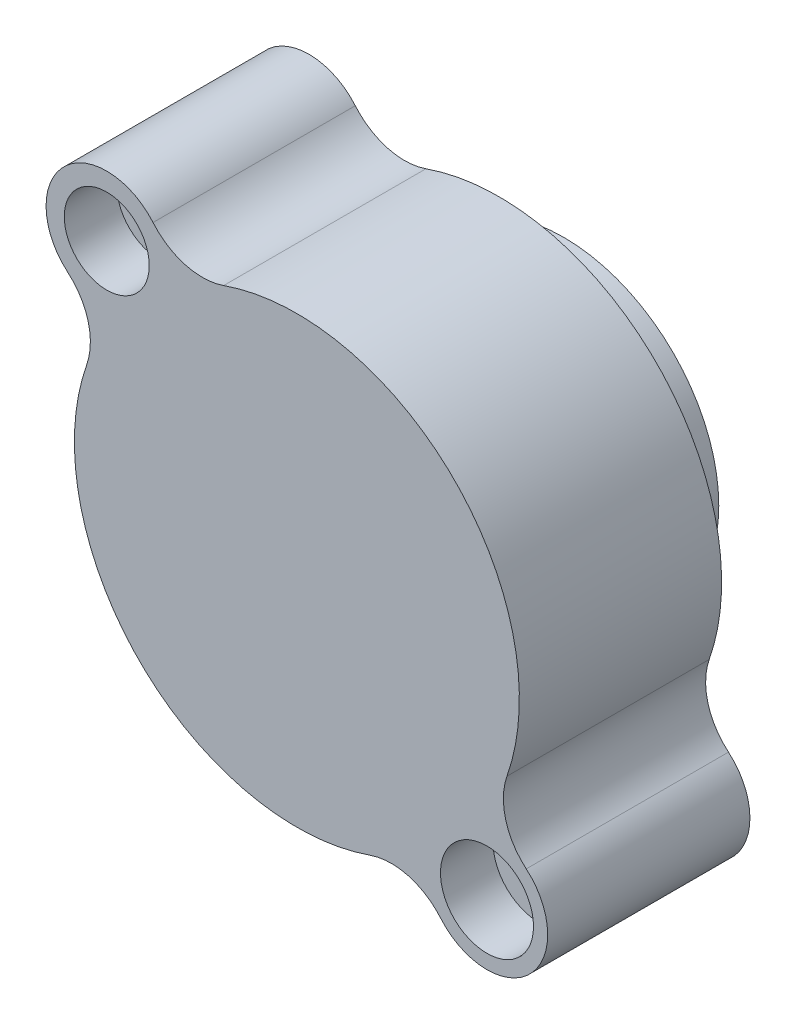
ISO-10303-21;
HEADER;
FILE_DESCRIPTION(('STEP AP214'),'2;1');
FILE_NAME('part.step','',(''),(''),'','','');
FILE_SCHEMA(('AUTOMOTIVE_DESIGN { 1 0 10303 214 1 1 1 1 }'));
ENDSEC;
DATA;
#1=APPLICATION_CONTEXT('core data for automotive mechanical design processes');
#2=APPLICATION_PROTOCOL_DEFINITION('international standard','automotive_design',2000,#1);
#3=PRODUCT_CONTEXT('',#1,'mechanical');
#4=PRODUCT('Part','Part','',(#3));
#5=PRODUCT_RELATED_PRODUCT_CATEGORY('part','',(#4));
#6=PRODUCT_DEFINITION_FORMATION('','',#4);
#7=PRODUCT_DEFINITION_CONTEXT('part definition',#1,'design');
#8=PRODUCT_DEFINITION('design','',#6,#7);
#9=PRODUCT_DEFINITION_SHAPE('','',#8);
#10=(LENGTH_UNIT() NAMED_UNIT(*) SI_UNIT(.MILLI.,.METRE.));
#11=(NAMED_UNIT(*) PLANE_ANGLE_UNIT() SI_UNIT($,.RADIAN.));
#12=(NAMED_UNIT(*) SI_UNIT($,.STERADIAN.) SOLID_ANGLE_UNIT());
#13=UNCERTAINTY_MEASURE_WITH_UNIT(LENGTH_MEASURE(1.E-05),#10,'distance_accuracy_value','');
#14=(GEOMETRIC_REPRESENTATION_CONTEXT(3) GLOBAL_UNCERTAINTY_ASSIGNED_CONTEXT((#13)) GLOBAL_UNIT_ASSIGNED_CONTEXT((#10,
#11,#12)) REPRESENTATION_CONTEXT('',''));
#15=CARTESIAN_POINT('',(0.,0.,0.));
#16=DIRECTION('',(0.,0.,1.));
#17=DIRECTION('',(1.,0.,0.));
#18=AXIS2_PLACEMENT_3D('',#15,#16,#17);
#19=CARTESIAN_POINT('',(-724.208508460082,446.758512816513,203.2));
#20=DIRECTION('',(0.,0.,1.));
#21=DIRECTION('',(1.,0.,0.));
#22=AXIS2_PLACEMENT_3D('',#19,#20,#21);
#23=PLANE('',#22);
#24=CARTESIAN_POINT('',(596.9,-596.9,203.2));
#25=DIRECTION('',(0.,0.,1.));
#26=DIRECTION('',(1.,0.,0.));
#27=AXIS2_PLACEMENT_3D('',#24,#25,#26);
#28=CIRCLE('',#27,69.85);
#29=CARTESIAN_POINT('',(666.75,-596.9,203.2));
#30=VERTEX_POINT('',#29);
#31=EDGE_CURVE('E39',#30,#30,#28,.T.);
#32=ORIENTED_EDGE('',*,*,#31,.T.);
#33=EDGE_LOOP('',(#32));
#34=FACE_BOUND('',#33,.T.);
#35=CARTESIAN_POINT('',(-596.9,596.9,203.2));
#36=DIRECTION('',(0.,0.,1.));
#37=DIRECTION('',(1.,0.,0.));
#38=AXIS2_PLACEMENT_3D('',#35,#36,#37);
#39=CIRCLE('',#38,69.85);
#40=CARTESIAN_POINT('',(-527.05,596.9,203.2));
#41=VERTEX_POINT('',#40);
#42=EDGE_CURVE('E168',#41,#41,#39,.T.);
#43=ORIENTED_EDGE('',*,*,#42,.T.);
#44=EDGE_LOOP('',(#43));
#45=FACE_BOUND('',#44,.T.);
#46=CARTESIAN_POINT('',(-596.9,596.9,203.2));
#47=DIRECTION('',(0.,0.,1.));
#48=DIRECTION('',(1.,0.,0.));
#49=AXIS2_PLACEMENT_3D('',#46,#47,#48);
#50=CIRCLE('',#49,190.5);
#51=CARTESIAN_POINT('',(-451.601786596628,720.101782380728,203.2));
#52=VERTEX_POINT('',#51);
#53=CARTESIAN_POINT('',(-720.101782380725,451.601786596626,203.2));
#54=VERTEX_POINT('',#53);
#55=EDGE_CURVE('E158',#52,#54,#50,.T.);
#56=ORIENTED_EDGE('',*,*,#55,.F.);
#57=CARTESIAN_POINT('',(-296.617025633027,851.517016920165,203.2));
#58=DIRECTION('',(0.,0.,-1.));
#59=DIRECTION('',(-1.,0.,0.));
#60=AXIS2_PLACEMENT_3D('',#57,#58,#59);
#61=CIRCLE('',#60,203.2);
#62=CARTESIAN_POINT('',(-229.773752250937,659.625858177592,203.2));
#63=VERTEX_POINT('',#62);
#64=EDGE_CURVE('E126',#63,#52,#61,.T.);
#65=ORIENTED_EDGE('',*,*,#64,.F.);
#66=CARTESIAN_POINT('',(0.,0.,203.2));
#67=DIRECTION('',(0.,0.,1.));
#68=DIRECTION('',(1.,0.,0.));
#69=AXIS2_PLACEMENT_3D('',#66,#67,#68);
#70=CIRCLE('',#69,698.5);
#71=CARTESIAN_POINT('',(659.625858177592,-229.773752250936,203.2));
#72=VERTEX_POINT('',#71);
#73=EDGE_CURVE('E111',#72,#63,#70,.T.);
#74=ORIENTED_EDGE('',*,*,#73,.F.);
#75=CARTESIAN_POINT('',(851.517016920165,-296.617025633027,203.2));
#76=DIRECTION('',(0.,0.,-1.));
#77=DIRECTION('',(-1.,0.,0.));
#78=AXIS2_PLACEMENT_3D('',#75,#76,#77);
#79=CIRCLE('',#78,203.2);
#80=CARTESIAN_POINT('',(720.101782380725,-451.601786596626,203.2));
#81=VERTEX_POINT('',#80);
#82=EDGE_CURVE('E124',#81,#72,#79,.T.);
#83=ORIENTED_EDGE('',*,*,#82,.F.);
#84=CARTESIAN_POINT('',(596.9,-596.9,203.2));
#85=DIRECTION('',(0.,0.,1.));
#86=DIRECTION('',(1.,0.,0.));
#87=AXIS2_PLACEMENT_3D('',#84,#85,#86);
#88=CIRCLE('',#87,190.5);
#89=CARTESIAN_POINT('',(451.601786596626,-720.101782380725,203.2));
#90=VERTEX_POINT('',#89);
#91=EDGE_CURVE('E129',#90,#81,#88,.T.);
#92=ORIENTED_EDGE('',*,*,#91,.F.);
#93=CARTESIAN_POINT('',(296.617025633027,-851.517016920165,203.2));
#94=DIRECTION('',(0.,0.,-1.));
#95=DIRECTION('',(-1.,0.,0.));
#96=AXIS2_PLACEMENT_3D('',#93,#94,#95);
#97=CIRCLE('',#96,203.2);
#98=CARTESIAN_POINT('',(229.773752250936,-659.625858177593,203.2));
#99=VERTEX_POINT('',#98);
#100=EDGE_CURVE('E131',#99,#90,#97,.T.);
#101=ORIENTED_EDGE('',*,*,#100,.F.);
#102=CARTESIAN_POINT('',(0.,0.,203.2));
#103=DIRECTION('',(0.,0.,1.));
#104=DIRECTION('',(1.,0.,0.));
#105=AXIS2_PLACEMENT_3D('',#102,#103,#104);
#106=CIRCLE('',#105,698.5);
#107=CARTESIAN_POINT('',(-659.625858177592,229.773752250936,203.2));
#108=VERTEX_POINT('',#107);
#109=EDGE_CURVE('E188',#108,#99,#106,.T.);
#110=ORIENTED_EDGE('',*,*,#109,.F.);
#111=CARTESIAN_POINT('',(-851.517016920165,296.617025633026,203.2));
#112=DIRECTION('',(0.,0.,-1.));
#113=DIRECTION('',(-1.,0.,0.));
#114=AXIS2_PLACEMENT_3D('',#111,#112,#113);
#115=CIRCLE('',#114,203.2);
#116=EDGE_CURVE('E186',#54,#108,#115,.T.);
#117=ORIENTED_EDGE('',*,*,#116,.F.);
#118=EDGE_LOOP('',(#56,#65,#74,#83,#92,#101,#110,#117));
#119=FACE_BOUND('',#118,.T.);
#120=CARTESIAN_POINT('',(0.,0.,203.2));
#121=DIRECTION('',(0.,0.,1.));
#122=DIRECTION('',(1.,0.,0.));
#123=AXIS2_PLACEMENT_3D('',#120,#121,#122);
#124=CIRCLE('',#123,486.41);
#125=CARTESIAN_POINT('',(486.41,0.,203.2));
#126=VERTEX_POINT('',#125);
#127=EDGE_CURVE('E11',#126,#126,#124,.F.);
#128=ORIENTED_EDGE('',*,*,#127,.F.);
#129=EDGE_LOOP('',(#128));
#130=FACE_BOUND('',#129,.T.);
#131=ADVANCED_FACE('F35',(#34,#45,#119,#130),#23,.F.);
#132=CARTESIAN_POINT('',(-596.9,596.9,203.2));
#133=DIRECTION('',(0.,0.,1.));
#134=DIRECTION('',(1.,0.,0.));
#135=AXIS2_PLACEMENT_3D('',#132,#133,#134);
#136=CYLINDRICAL_SURFACE('',#135,190.5);
#137=CARTESIAN_POINT('',(-596.9,596.9,838.2));
#138=DIRECTION('',(0.,0.,1.));
#139=DIRECTION('',(1.,0.,0.));
#140=AXIS2_PLACEMENT_3D('',#137,#138,#139);
#141=CIRCLE('',#140,190.5);
#142=CARTESIAN_POINT('',(-451.601786596628,720.101782380728,838.2));
#143=VERTEX_POINT('',#142);
#144=CARTESIAN_POINT('',(-720.101782380725,451.601786596626,838.2));
#145=VERTEX_POINT('',#144);
#146=EDGE_CURVE('E136',#143,#145,#141,.T.);
#147=ORIENTED_EDGE('',*,*,#146,.F.);
#148=DIRECTION('',(0.,0.,1.));
#149=VECTOR('',#148,1.);
#150=CARTESIAN_POINT('',(-451.601786596628,720.101782380728,203.2));
#151=LINE('',#150,#149);
#152=EDGE_CURVE('E45',#52,#143,#151,.T.);
#153=ORIENTED_EDGE('',*,*,#152,.F.);
#154=ORIENTED_EDGE('',*,*,#55,.T.);
#155=DIRECTION('',(0.,0.,1.));
#156=VECTOR('',#155,1.);
#157=CARTESIAN_POINT('',(-720.101782380725,451.601786596626,203.2));
#158=LINE('',#157,#156);
#159=EDGE_CURVE('E94',#54,#145,#158,.T.);
#160=ORIENTED_EDGE('',*,*,#159,.T.);
#161=EDGE_LOOP('',(#147,#153,#154,#160));
#162=FACE_BOUND('',#161,.T.);
#163=ADVANCED_FACE('F37',(#162),#136,.T.);
#164=CARTESIAN_POINT('',(-296.617025633027,851.517016920165,203.2));
#165=DIRECTION('',(0.,0.,1.));
#166=DIRECTION('',(1.,0.,0.));
#167=AXIS2_PLACEMENT_3D('',#164,#165,#166);
#168=CYLINDRICAL_SURFACE('',#167,203.2);
#169=CARTESIAN_POINT('',(-296.617025633027,851.517016920165,838.2));
#170=DIRECTION('',(0.,0.,-1.));
#171=DIRECTION('',(-1.,0.,0.));
#172=AXIS2_PLACEMENT_3D('',#169,#170,#171);
#173=CIRCLE('',#172,203.2);
#174=CARTESIAN_POINT('',(-229.773752250937,659.625858177592,838.2));
#175=VERTEX_POINT('',#174);
#176=EDGE_CURVE('E155',#175,#143,#173,.T.);
#177=ORIENTED_EDGE('',*,*,#176,.F.);
#178=DIRECTION('',(0.,0.,1.));
#179=VECTOR('',#178,1.);
#180=CARTESIAN_POINT('',(-229.773752250937,659.625858177592,203.2));
#181=LINE('',#180,#179);
#182=EDGE_CURVE('E82',#63,#175,#181,.T.);
#183=ORIENTED_EDGE('',*,*,#182,.F.);
#184=ORIENTED_EDGE('',*,*,#64,.T.);
#185=ORIENTED_EDGE('',*,*,#152,.T.);
#186=EDGE_LOOP('',(#177,#183,#184,#185));
#187=FACE_BOUND('',#186,.T.);
#188=ADVANCED_FACE('F203',(#187),#168,.F.);
#189=CARTESIAN_POINT('',(0.,0.,203.2));
#190=DIRECTION('',(0.,0.,1.));
#191=DIRECTION('',(1.,0.,0.));
#192=AXIS2_PLACEMENT_3D('',#189,#190,#191);
#193=CYLINDRICAL_SURFACE('',#192,698.5);
#194=CARTESIAN_POINT('',(0.,0.,838.2));
#195=DIRECTION('',(0.,0.,1.));
#196=DIRECTION('',(1.,0.,0.));
#197=AXIS2_PLACEMENT_3D('',#194,#195,#196);
#198=CIRCLE('',#197,698.5);
#199=CARTESIAN_POINT('',(659.625858177592,-229.773752250936,838.2));
#200=VERTEX_POINT('',#199);
#201=EDGE_CURVE('E113',#200,#175,#198,.T.);
#202=ORIENTED_EDGE('',*,*,#201,.F.);
#203=DIRECTION('',(0.,0.,1.));
#204=VECTOR('',#203,1.);
#205=CARTESIAN_POINT('',(659.625858177592,-229.773752250936,203.2));
#206=LINE('',#205,#204);
#207=EDGE_CURVE('E108',#72,#200,#206,.T.);
#208=ORIENTED_EDGE('',*,*,#207,.F.);
#209=ORIENTED_EDGE('',*,*,#73,.T.);
#210=ORIENTED_EDGE('',*,*,#182,.T.);
#211=EDGE_LOOP('',(#202,#208,#209,#210));
#212=FACE_BOUND('',#211,.T.);
#213=ADVANCED_FACE('F110',(#212),#193,.T.);
#214=CARTESIAN_POINT('',(851.517016920165,-296.617025633027,203.2));
#215=DIRECTION('',(0.,0.,1.));
#216=DIRECTION('',(1.,0.,0.));
#217=AXIS2_PLACEMENT_3D('',#214,#215,#216);
#218=CYLINDRICAL_SURFACE('',#217,203.2);
#219=CARTESIAN_POINT('',(851.517016920165,-296.617025633027,838.2));
#220=DIRECTION('',(0.,0.,-1.));
#221=DIRECTION('',(-1.,0.,0.));
#222=AXIS2_PLACEMENT_3D('',#219,#220,#221);
#223=CIRCLE('',#222,203.2);
#224=CARTESIAN_POINT('',(720.101782380725,-451.601786596626,838.2));
#225=VERTEX_POINT('',#224);
#226=EDGE_CURVE('E152',#225,#200,#223,.T.);
#227=ORIENTED_EDGE('',*,*,#226,.F.);
#228=DIRECTION('',(0.,0.,1.));
#229=VECTOR('',#228,1.);
#230=CARTESIAN_POINT('',(720.101782380725,-451.601786596626,203.2));
#231=LINE('',#230,#229);
#232=EDGE_CURVE('E118',#81,#225,#231,.T.);
#233=ORIENTED_EDGE('',*,*,#232,.F.);
#234=ORIENTED_EDGE('',*,*,#82,.T.);
#235=ORIENTED_EDGE('',*,*,#207,.T.);
#236=EDGE_LOOP('',(#227,#233,#234,#235));
#237=FACE_BOUND('',#236,.T.);
#238=ADVANCED_FACE('F128',(#237),#218,.F.);
#239=CARTESIAN_POINT('',(596.9,-596.9,203.2));
#240=DIRECTION('',(0.,0.,1.));
#241=DIRECTION('',(1.,0.,0.));
#242=AXIS2_PLACEMENT_3D('',#239,#240,#241);
#243=CYLINDRICAL_SURFACE('',#242,190.5);
#244=CARTESIAN_POINT('',(596.9,-596.9,838.2));
#245=DIRECTION('',(0.,0.,1.));
#246=DIRECTION('',(1.,0.,0.));
#247=AXIS2_PLACEMENT_3D('',#244,#245,#246);
#248=CIRCLE('',#247,190.5);
#249=CARTESIAN_POINT('',(451.601786596626,-720.101782380725,838.2));
#250=VERTEX_POINT('',#249);
#251=EDGE_CURVE('E149',#250,#225,#248,.T.);
#252=ORIENTED_EDGE('',*,*,#251,.F.);
#253=DIRECTION('',(0.,0.,1.));
#254=VECTOR('',#253,1.);
#255=CARTESIAN_POINT('',(451.601786596626,-720.101782380725,203.2));
#256=LINE('',#255,#254);
#257=EDGE_CURVE('E162',#90,#250,#256,.T.);
#258=ORIENTED_EDGE('',*,*,#257,.F.);
#259=ORIENTED_EDGE('',*,*,#91,.T.);
#260=ORIENTED_EDGE('',*,*,#232,.T.);
#261=EDGE_LOOP('',(#252,#258,#259,#260));
#262=FACE_BOUND('',#261,.T.);
#263=ADVANCED_FACE('F347',(#262),#243,.T.);
#264=CARTESIAN_POINT('',(296.617025633027,-851.517016920165,203.2));
#265=DIRECTION('',(0.,0.,1.));
#266=DIRECTION('',(1.,0.,0.));
#267=AXIS2_PLACEMENT_3D('',#264,#265,#266);
#268=CYLINDRICAL_SURFACE('',#267,203.2);
#269=CARTESIAN_POINT('',(296.617025633027,-851.517016920165,838.2));
#270=DIRECTION('',(0.,0.,-1.));
#271=DIRECTION('',(-1.,0.,0.));
#272=AXIS2_PLACEMENT_3D('',#269,#270,#271);
#273=CIRCLE('',#272,203.2);
#274=CARTESIAN_POINT('',(229.773752250936,-659.625858177593,838.2));
#275=VERTEX_POINT('',#274);
#276=EDGE_CURVE('E146',#275,#250,#273,.T.);
#277=ORIENTED_EDGE('',*,*,#276,.F.);
#278=DIRECTION('',(0.,0.,1.));
#279=VECTOR('',#278,1.);
#280=CARTESIAN_POINT('',(229.773752250936,-659.625858177593,203.2));
#281=LINE('',#280,#279);
#282=EDGE_CURVE('E164',#99,#275,#281,.T.);
#283=ORIENTED_EDGE('',*,*,#282,.F.);
#284=ORIENTED_EDGE('',*,*,#100,.T.);
#285=ORIENTED_EDGE('',*,*,#257,.T.);
#286=EDGE_LOOP('',(#277,#283,#284,#285));
#287=FACE_BOUND('',#286,.T.);
#288=ADVANCED_FACE('F194',(#287),#268,.F.);
#289=CARTESIAN_POINT('',(0.,0.,203.2));
#290=DIRECTION('',(0.,0.,1.));
#291=DIRECTION('',(1.,0.,0.));
#292=AXIS2_PLACEMENT_3D('',#289,#290,#291);
#293=CYLINDRICAL_SURFACE('',#292,698.5);
#294=CARTESIAN_POINT('',(0.,0.,838.2));
#295=DIRECTION('',(0.,0.,1.));
#296=DIRECTION('',(1.,0.,0.));
#297=AXIS2_PLACEMENT_3D('',#294,#295,#296);
#298=CIRCLE('',#297,698.5);
#299=CARTESIAN_POINT('',(-659.625858177592,229.773752250936,838.2));
#300=VERTEX_POINT('',#299);
#301=EDGE_CURVE('E143',#300,#275,#298,.T.);
#302=ORIENTED_EDGE('',*,*,#301,.F.);
#303=DIRECTION('',(0.,0.,1.));
#304=VECTOR('',#303,1.);
#305=CARTESIAN_POINT('',(-659.625858177592,229.773752250936,203.2));
#306=LINE('',#305,#304);
#307=EDGE_CURVE('E166',#108,#300,#306,.T.);
#308=ORIENTED_EDGE('',*,*,#307,.F.);
#309=ORIENTED_EDGE('',*,*,#109,.T.);
#310=ORIENTED_EDGE('',*,*,#282,.T.);
#311=EDGE_LOOP('',(#302,#308,#309,#310));
#312=FACE_BOUND('',#311,.T.);
#313=ADVANCED_FACE('F199',(#312),#293,.T.);
#314=CARTESIAN_POINT('',(-851.517016920165,296.617025633026,203.2));
#315=DIRECTION('',(0.,0.,1.));
#316=DIRECTION('',(1.,0.,0.));
#317=AXIS2_PLACEMENT_3D('',#314,#315,#316);
#318=CYLINDRICAL_SURFACE('',#317,203.2);
#319=CARTESIAN_POINT('',(-851.517016920165,296.617025633026,838.2));
#320=DIRECTION('',(0.,0.,-1.));
#321=DIRECTION('',(-1.,0.,0.));
#322=AXIS2_PLACEMENT_3D('',#319,#320,#321);
#323=CIRCLE('',#322,203.2);
#324=EDGE_CURVE('E139',#145,#300,#323,.T.);
#325=ORIENTED_EDGE('',*,*,#324,.F.);
#326=ORIENTED_EDGE('',*,*,#159,.F.);
#327=ORIENTED_EDGE('',*,*,#116,.T.);
#328=ORIENTED_EDGE('',*,*,#307,.T.);
#329=EDGE_LOOP('',(#325,#326,#327,#328));
#330=FACE_BOUND('',#329,.T.);
#331=ADVANCED_FACE('F200',(#330),#318,.F.);
#332=CARTESIAN_POINT('',(-724.208508460082,446.758512816513,838.2));
#333=DIRECTION('',(0.,0.,1.));
#334=DIRECTION('',(1.,0.,0.));
#335=AXIS2_PLACEMENT_3D('',#332,#333,#334);
#336=PLANE('',#335);
#337=CARTESIAN_POINT('',(596.9,-596.9,838.2));
#338=DIRECTION('',(0.,0.,1.));
#339=DIRECTION('',(1.,0.,0.));
#340=AXIS2_PLACEMENT_3D('',#337,#338,#339);
#341=CIRCLE('',#340,146.05);
#342=CARTESIAN_POINT('',(742.95,-596.9,838.2));
#343=VERTEX_POINT('',#342);
#344=EDGE_CURVE('E232',#343,#343,#341,.T.);
#345=ORIENTED_EDGE('',*,*,#344,.F.);
#346=EDGE_LOOP('',(#345));
#347=FACE_BOUND('',#346,.T.);
#348=CARTESIAN_POINT('',(-596.9,596.9,838.2));
#349=DIRECTION('',(0.,0.,1.));
#350=DIRECTION('',(1.,0.,0.));
#351=AXIS2_PLACEMENT_3D('',#348,#349,#350);
#352=CIRCLE('',#351,133.35);
#353=CARTESIAN_POINT('',(-463.55,596.9,838.2));
#354=VERTEX_POINT('',#353);
#355=EDGE_CURVE('E181',#354,#354,#352,.T.);
#356=ORIENTED_EDGE('',*,*,#355,.F.);
#357=EDGE_LOOP('',(#356));
#358=FACE_BOUND('',#357,.T.);
#359=ORIENTED_EDGE('',*,*,#146,.T.);
#360=ORIENTED_EDGE('',*,*,#324,.T.);
#361=ORIENTED_EDGE('',*,*,#301,.T.);
#362=ORIENTED_EDGE('',*,*,#276,.T.);
#363=ORIENTED_EDGE('',*,*,#251,.T.);
#364=ORIENTED_EDGE('',*,*,#226,.T.);
#365=ORIENTED_EDGE('',*,*,#201,.T.);
#366=ORIENTED_EDGE('',*,*,#176,.T.);
#367=EDGE_LOOP('',(#359,#360,#361,#362,#363,#364,#365,#366));
#368=FACE_BOUND('',#367,.T.);
#369=ADVANCED_FACE('F202',(#347,#358,#368),#336,.T.);
#370=CARTESIAN_POINT('',(0.,0.,0.));
#371=DIRECTION('',(0.,0.,1.));
#372=DIRECTION('',(1.,0.,0.));
#373=AXIS2_PLACEMENT_3D('',#370,#371,#372);
#374=CYLINDRICAL_SURFACE('',#373,486.41);
#375=CARTESIAN_POINT('',(0.,0.,0.));
#376=DIRECTION('',(0.,0.,-1.));
#377=DIRECTION('',(-1.,0.,0.));
#378=AXIS2_PLACEMENT_3D('',#375,#376,#377);
#379=CIRCLE('',#378,486.41);
#380=CARTESIAN_POINT('',(-486.41,0.,0.));
#381=VERTEX_POINT('',#380);
#382=EDGE_CURVE('E140',#381,#381,#379,.T.);
#383=ORIENTED_EDGE('',*,*,#382,.F.);
#384=EDGE_LOOP('',(#383));
#385=FACE_BOUND('',#384,.T.);
#386=ORIENTED_EDGE('',*,*,#127,.T.);
#387=EDGE_LOOP('',(#386));
#388=FACE_BOUND('',#387,.T.);
#389=ADVANCED_FACE('F219',(#385,#388),#374,.T.);
#390=CARTESIAN_POINT('',(0.,0.,0.));
#391=DIRECTION('',(0.,0.,-1.));
#392=DIRECTION('',(-1.,0.,0.));
#393=AXIS2_PLACEMENT_3D('',#390,#391,#392);
#394=PLANE('',#393);
#395=ORIENTED_EDGE('',*,*,#382,.T.);
#396=EDGE_LOOP('',(#395));
#397=FACE_BOUND('',#396,.T.);
#398=ADVANCED_FACE('F227',(#397),#394,.T.);
#399=CARTESIAN_POINT('',(-596.9,596.9,838.2));
#400=DIRECTION('',(0.,0.,1.));
#401=DIRECTION('',(1.,0.,0.));
#402=AXIS2_PLACEMENT_3D('',#399,#400,#401);
#403=CYLINDRICAL_SURFACE('',#402,69.85);
#404=CARTESIAN_POINT('',(-596.9,596.9,673.1));
#405=DIRECTION('',(0.,0.,1.));
#406=DIRECTION('',(1.,0.,0.));
#407=AXIS2_PLACEMENT_3D('',#404,#405,#406);
#408=CIRCLE('',#407,69.85);
#409=CARTESIAN_POINT('',(-527.05,596.9,673.1));
#410=VERTEX_POINT('',#409);
#411=EDGE_CURVE('E170',#410,#410,#408,.T.);
#412=ORIENTED_EDGE('',*,*,#411,.T.);
#413=EDGE_LOOP('',(#412));
#414=FACE_BOUND('',#413,.T.);
#415=ORIENTED_EDGE('',*,*,#42,.F.);
#416=EDGE_LOOP('',(#415));
#417=FACE_BOUND('',#416,.T.);
#418=ADVANCED_FACE('F267',(#414,#417),#403,.F.);
#419=CARTESIAN_POINT('',(-527.05,596.9,673.1));
#420=DIRECTION('',(0.,0.,-1.));
#421=DIRECTION('',(-1.,0.,0.));
#422=AXIS2_PLACEMENT_3D('',#419,#420,#421);
#423=PLANE('',#422);
#424=ORIENTED_EDGE('',*,*,#411,.F.);
#425=EDGE_LOOP('',(#424));
#426=FACE_BOUND('',#425,.T.);
#427=CARTESIAN_POINT('',(-596.9,596.9,673.1));
#428=DIRECTION('',(0.,0.,1.));
#429=DIRECTION('',(1.,0.,0.));
#430=AXIS2_PLACEMENT_3D('',#427,#428,#429);
#431=CIRCLE('',#430,133.35);
#432=CARTESIAN_POINT('',(-463.55,596.9,673.1));
#433=VERTEX_POINT('',#432);
#434=EDGE_CURVE('E176',#433,#433,#431,.T.);
#435=ORIENTED_EDGE('',*,*,#434,.T.);
#436=EDGE_LOOP('',(#435));
#437=FACE_BOUND('',#436,.T.);
#438=ADVANCED_FACE('F263',(#426,#437),#423,.F.);
#439=CARTESIAN_POINT('',(-596.9,596.9,838.2));
#440=DIRECTION('',(0.,0.,1.));
#441=DIRECTION('',(1.,0.,0.));
#442=AXIS2_PLACEMENT_3D('',#439,#440,#441);
#443=CYLINDRICAL_SURFACE('',#442,133.35);
#444=ORIENTED_EDGE('',*,*,#434,.F.);
#445=EDGE_LOOP('',(#444));
#446=FACE_BOUND('',#445,.T.);
#447=ORIENTED_EDGE('',*,*,#355,.T.);
#448=EDGE_LOOP('',(#447));
#449=FACE_BOUND('',#448,.T.);
#450=ADVANCED_FACE('F259',(#446,#449),#443,.F.);
#451=CARTESIAN_POINT('',(596.9,-596.9,838.2));
#452=DIRECTION('',(0.,0.,1.));
#453=DIRECTION('',(1.,0.,0.));
#454=AXIS2_PLACEMENT_3D('',#451,#452,#453);
#455=CYLINDRICAL_SURFACE('',#454,69.85);
#456=CARTESIAN_POINT('',(596.9,-596.9,673.1));
#457=DIRECTION('',(0.,0.,1.));
#458=DIRECTION('',(1.,0.,0.));
#459=AXIS2_PLACEMENT_3D('',#456,#457,#458);
#460=CIRCLE('',#459,69.85);
#461=CARTESIAN_POINT('',(666.75,-596.9,673.1));
#462=VERTEX_POINT('',#461);
#463=EDGE_CURVE('E236',#462,#462,#460,.T.);
#464=ORIENTED_EDGE('',*,*,#463,.T.);
#465=EDGE_LOOP('',(#464));
#466=FACE_BOUND('',#465,.T.);
#467=ORIENTED_EDGE('',*,*,#31,.F.);
#468=EDGE_LOOP('',(#467));
#469=FACE_BOUND('',#468,.T.);
#470=ADVANCED_FACE('F252',(#466,#469),#455,.F.);
#471=CARTESIAN_POINT('',(666.75,-596.9,673.1));
#472=DIRECTION('',(0.,0.,-1.));
#473=DIRECTION('',(-1.,0.,0.));
#474=AXIS2_PLACEMENT_3D('',#471,#472,#473);
#475=PLANE('',#474);
#476=ORIENTED_EDGE('',*,*,#463,.F.);
#477=EDGE_LOOP('',(#476));
#478=FACE_BOUND('',#477,.T.);
#479=CARTESIAN_POINT('',(596.9,-596.9,673.1));
#480=DIRECTION('',(0.,0.,1.));
#481=DIRECTION('',(1.,0.,0.));
#482=AXIS2_PLACEMENT_3D('',#479,#480,#481);
#483=CIRCLE('',#482,146.05);
#484=CARTESIAN_POINT('',(742.95,-596.9,673.1));
#485=VERTEX_POINT('',#484);
#486=EDGE_CURVE('E240',#485,#485,#483,.T.);
#487=ORIENTED_EDGE('',*,*,#486,.T.);
#488=EDGE_LOOP('',(#487));
#489=FACE_BOUND('',#488,.T.);
#490=ADVANCED_FACE('F246',(#478,#489),#475,.F.);
#491=CARTESIAN_POINT('',(596.9,-596.9,838.2));
#492=DIRECTION('',(0.,0.,1.));
#493=DIRECTION('',(1.,0.,0.));
#494=AXIS2_PLACEMENT_3D('',#491,#492,#493);
#495=CYLINDRICAL_SURFACE('',#494,146.05);
#496=ORIENTED_EDGE('',*,*,#486,.F.);
#497=EDGE_LOOP('',(#496));
#498=FACE_BOUND('',#497,.T.);
#499=ORIENTED_EDGE('',*,*,#344,.T.);
#500=EDGE_LOOP('',(#499));
#501=FACE_BOUND('',#500,.T.);
#502=ADVANCED_FACE('F244',(#498,#501),#495,.F.);
#503=CLOSED_SHELL('',(#131,#163,#188,#213,#238,#263,#288,#313,#331,#369,#389,#398,#418,#438,
#450,#470,#490,#502));
#504=MANIFOLD_SOLID_BREP('B2',#503);
#505=ADVANCED_BREP_SHAPE_REPRESENTATION('',(#18,#504),#14);
#506=SHAPE_DEFINITION_REPRESENTATION(#9,#505);
ENDSEC;
END-ISO-10303-21;
